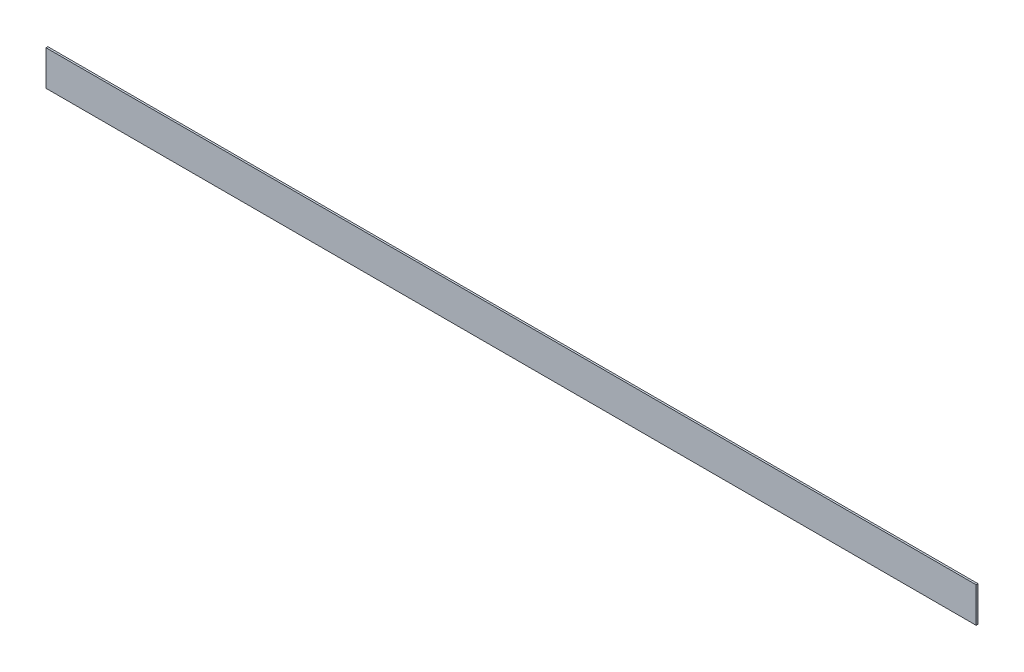
ISO-10303-21;
HEADER;
FILE_DESCRIPTION(('STEP AP214'),'2;1');
FILE_NAME('part.step','',(''),(''),'','','');
FILE_SCHEMA(('AUTOMOTIVE_DESIGN { 1 0 10303 214 1 1 1 1 }'));
ENDSEC;
DATA;
#1=APPLICATION_CONTEXT('core data for automotive mechanical design processes');
#2=APPLICATION_PROTOCOL_DEFINITION('international standard','automotive_design',2000,#1);
#3=PRODUCT_CONTEXT('',#1,'mechanical');
#4=PRODUCT('Part','Part','',(#3));
#5=PRODUCT_RELATED_PRODUCT_CATEGORY('part','',(#4));
#6=PRODUCT_DEFINITION_FORMATION('','',#4);
#7=PRODUCT_DEFINITION_CONTEXT('part definition',#1,'design');
#8=PRODUCT_DEFINITION('design','',#6,#7);
#9=PRODUCT_DEFINITION_SHAPE('','',#8);
#10=(LENGTH_UNIT() NAMED_UNIT(*) SI_UNIT(.MILLI.,.METRE.));
#11=(NAMED_UNIT(*) PLANE_ANGLE_UNIT() SI_UNIT($,.RADIAN.));
#12=(NAMED_UNIT(*) SI_UNIT($,.STERADIAN.) SOLID_ANGLE_UNIT());
#13=UNCERTAINTY_MEASURE_WITH_UNIT(LENGTH_MEASURE(1.E-05),#10,'distance_accuracy_value','');
#14=(GEOMETRIC_REPRESENTATION_CONTEXT(3) GLOBAL_UNCERTAINTY_ASSIGNED_CONTEXT((#13)) GLOBAL_UNIT_ASSIGNED_CONTEXT((#10,
#11,#12)) REPRESENTATION_CONTEXT('',''));
#15=CARTESIAN_POINT('',(0.,0.,0.));
#16=DIRECTION('',(0.,0.,1.));
#17=DIRECTION('',(1.,0.,0.));
#18=AXIS2_PLACEMENT_3D('',#15,#16,#17);
#19=CARTESIAN_POINT('',(0.,0.,25.4));
#20=DIRECTION('',(1.,0.,0.));
#21=DIRECTION('',(0.,1.,0.));
#22=AXIS2_PLACEMENT_3D('',#19,#20,#21);
#23=PLANE('',#22);
#24=DIRECTION('',(0.,-1.,0.));
#25=VECTOR('',#24,1.);
#26=CARTESIAN_POINT('',(0.,0.,0.));
#27=LINE('',#26,#25);
#28=CARTESIAN_POINT('',(0.,0.,0.));
#29=VERTEX_POINT('',#28);
#30=CARTESIAN_POINT('',(0.,-480.,0.));
#31=VERTEX_POINT('',#30);
#32=EDGE_CURVE('E100',#29,#31,#27,.T.);
#33=ORIENTED_EDGE('',*,*,#32,.T.);
#34=DIRECTION('',(0.,0.,-1.));
#35=VECTOR('',#34,1.);
#36=CARTESIAN_POINT('',(0.,-480.,25.4));
#37=LINE('',#36,#35);
#38=CARTESIAN_POINT('',(0.,-480.,25.4));
#39=VERTEX_POINT('',#38);
#40=EDGE_CURVE('E11',#39,#31,#37,.T.);
#41=ORIENTED_EDGE('',*,*,#40,.F.);
#42=DIRECTION('',(0.,-1.,0.));
#43=VECTOR('',#42,1.);
#44=CARTESIAN_POINT('',(0.,0.,25.4));
#45=LINE('',#44,#43);
#46=CARTESIAN_POINT('',(0.,0.,25.4));
#47=VERTEX_POINT('',#46);
#48=EDGE_CURVE('E88',#47,#39,#45,.T.);
#49=ORIENTED_EDGE('',*,*,#48,.F.);
#50=DIRECTION('',(0.,0.,-1.));
#51=VECTOR('',#50,1.);
#52=CARTESIAN_POINT('',(0.,0.,25.4));
#53=LINE('',#52,#51);
#54=EDGE_CURVE('E96',#47,#29,#53,.T.);
#55=ORIENTED_EDGE('',*,*,#54,.T.);
#56=EDGE_LOOP('',(#33,#41,#49,#55));
#57=FACE_BOUND('',#56,.T.);
#58=ADVANCED_FACE('F37',(#57),#23,.F.);
#59=CARTESIAN_POINT('',(0.,-480.,25.4));
#60=DIRECTION('',(0.,1.,0.));
#61=DIRECTION('',(0.,0.,1.));
#62=AXIS2_PLACEMENT_3D('',#59,#60,#61);
#63=PLANE('',#62);
#64=DIRECTION('',(1.,0.,0.));
#65=VECTOR('',#64,1.);
#66=CARTESIAN_POINT('',(0.,-480.,0.));
#67=LINE('',#66,#65);
#68=CARTESIAN_POINT('',(12700.,-480.,0.));
#69=VERTEX_POINT('',#68);
#70=EDGE_CURVE('E92',#31,#69,#67,.T.);
#71=ORIENTED_EDGE('',*,*,#70,.T.);
#72=DIRECTION('',(0.,0.,-1.));
#73=VECTOR('',#72,1.);
#74=CARTESIAN_POINT('',(12700.,-480.,25.4));
#75=LINE('',#74,#73);
#76=CARTESIAN_POINT('',(12700.,-480.,25.4));
#77=VERTEX_POINT('',#76);
#78=EDGE_CURVE('E45',#77,#69,#75,.T.);
#79=ORIENTED_EDGE('',*,*,#78,.F.);
#80=DIRECTION('',(1.,0.,0.));
#81=VECTOR('',#80,1.);
#82=CARTESIAN_POINT('',(0.,-480.,25.4));
#83=LINE('',#82,#81);
#84=EDGE_CURVE('E83',#39,#77,#83,.T.);
#85=ORIENTED_EDGE('',*,*,#84,.F.);
#86=ORIENTED_EDGE('',*,*,#40,.T.);
#87=EDGE_LOOP('',(#71,#79,#85,#86));
#88=FACE_BOUND('',#87,.T.);
#89=ADVANCED_FACE('F91',(#88),#63,.F.);
#90=CARTESIAN_POINT('',(12700.,0.,25.4));
#91=DIRECTION('',(-1.,0.,0.));
#92=DIRECTION('',(0.,0.,1.));
#93=AXIS2_PLACEMENT_3D('',#90,#91,#92);
#94=PLANE('',#93);
#95=DIRECTION('',(0.,1.,0.));
#96=VECTOR('',#95,1.);
#97=CARTESIAN_POINT('',(12700.,0.,0.));
#98=LINE('',#97,#96);
#99=CARTESIAN_POINT('',(12700.,0.,0.));
#100=VERTEX_POINT('',#99);
#101=EDGE_CURVE('E70',#69,#100,#98,.T.);
#102=ORIENTED_EDGE('',*,*,#101,.T.);
#103=DIRECTION('',(0.,0.,-1.));
#104=VECTOR('',#103,1.);
#105=CARTESIAN_POINT('',(12700.,0.,25.4));
#106=LINE('',#105,#104);
#107=CARTESIAN_POINT('',(12700.,0.,25.4));
#108=VERTEX_POINT('',#107);
#109=EDGE_CURVE('E93',#108,#100,#106,.T.);
#110=ORIENTED_EDGE('',*,*,#109,.F.);
#111=DIRECTION('',(0.,1.,0.));
#112=VECTOR('',#111,1.);
#113=CARTESIAN_POINT('',(12700.,0.,25.4));
#114=LINE('',#113,#112);
#115=EDGE_CURVE('E86',#77,#108,#114,.T.);
#116=ORIENTED_EDGE('',*,*,#115,.F.);
#117=ORIENTED_EDGE('',*,*,#78,.T.);
#118=EDGE_LOOP('',(#102,#110,#116,#117));
#119=FACE_BOUND('',#118,.T.);
#120=ADVANCED_FACE('F94',(#119),#94,.F.);
#121=CARTESIAN_POINT('',(0.,0.,25.4));
#122=DIRECTION('',(0.,-1.,0.));
#123=DIRECTION('',(0.,0.,-1.));
#124=AXIS2_PLACEMENT_3D('',#121,#122,#123);
#125=PLANE('',#124);
#126=DIRECTION('',(-1.,0.,0.));
#127=VECTOR('',#126,1.);
#128=CARTESIAN_POINT('',(0.,0.,0.));
#129=LINE('',#128,#127);
#130=EDGE_CURVE('E76',#100,#29,#129,.T.);
#131=ORIENTED_EDGE('',*,*,#130,.T.);
#132=ORIENTED_EDGE('',*,*,#54,.F.);
#133=DIRECTION('',(-1.,0.,0.));
#134=VECTOR('',#133,1.);
#135=CARTESIAN_POINT('',(0.,0.,25.4));
#136=LINE('',#135,#134);
#137=EDGE_CURVE('E53',#108,#47,#136,.T.);
#138=ORIENTED_EDGE('',*,*,#137,.F.);
#139=ORIENTED_EDGE('',*,*,#109,.T.);
#140=EDGE_LOOP('',(#131,#132,#138,#139));
#141=FACE_BOUND('',#140,.T.);
#142=ADVANCED_FACE('F107',(#141),#125,.F.);
#143=CARTESIAN_POINT('',(0.,0.,25.4));
#144=DIRECTION('',(0.,0.,1.));
#145=DIRECTION('',(1.,0.,0.));
#146=AXIS2_PLACEMENT_3D('',#143,#144,#145);
#147=PLANE('',#146);
#148=ORIENTED_EDGE('',*,*,#48,.T.);
#149=ORIENTED_EDGE('',*,*,#84,.T.);
#150=ORIENTED_EDGE('',*,*,#115,.T.);
#151=ORIENTED_EDGE('',*,*,#137,.T.);
#152=EDGE_LOOP('',(#148,#149,#150,#151));
#153=FACE_BOUND('',#152,.T.);
#154=ADVANCED_FACE('F84',(#153),#147,.T.);
#155=CARTESIAN_POINT('',(0.,0.,0.));
#156=DIRECTION('',(0.,0.,1.));
#157=DIRECTION('',(1.,0.,0.));
#158=AXIS2_PLACEMENT_3D('',#155,#156,#157);
#159=PLANE('',#158);
#160=ORIENTED_EDGE('',*,*,#32,.F.);
#161=ORIENTED_EDGE('',*,*,#130,.F.);
#162=ORIENTED_EDGE('',*,*,#101,.F.);
#163=ORIENTED_EDGE('',*,*,#70,.F.);
#164=EDGE_LOOP('',(#160,#161,#162,#163));
#165=FACE_BOUND('',#164,.T.);
#166=ADVANCED_FACE('F110',(#165),#159,.F.);
#167=CLOSED_SHELL('',(#58,#89,#120,#142,#154,#166));
#168=MANIFOLD_SOLID_BREP('B2',#167);
#169=ADVANCED_BREP_SHAPE_REPRESENTATION('',(#18,#168),#14);
#170=SHAPE_DEFINITION_REPRESENTATION(#9,#169);
ENDSEC;
END-ISO-10303-21;
